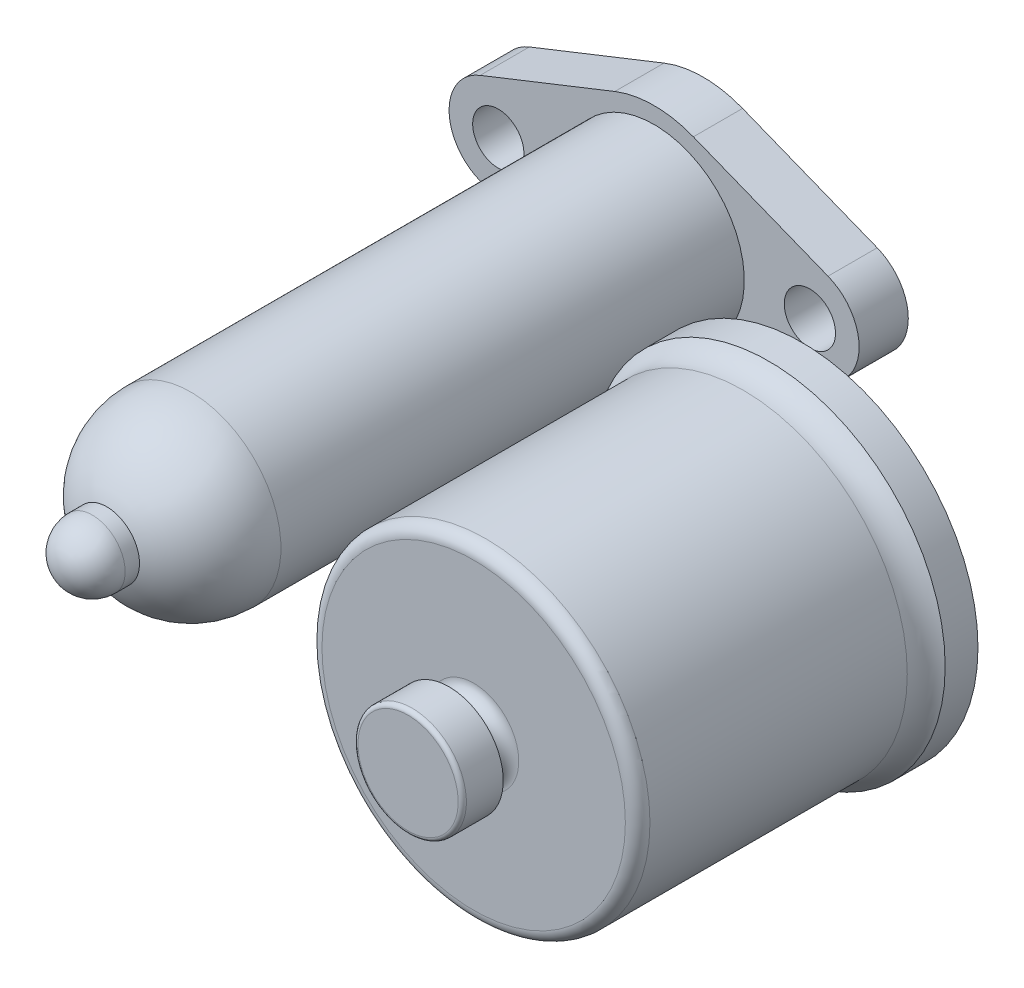
ISO-10303-21;
HEADER;
FILE_DESCRIPTION(('STEP AP214'),'2;1');
FILE_NAME('part.step','',(''),(''),'','','');
FILE_SCHEMA(('AUTOMOTIVE_DESIGN { 1 0 10303 214 1 1 1 1 }'));
ENDSEC;
DATA;
#1=APPLICATION_CONTEXT('core data for automotive mechanical design processes');
#2=APPLICATION_PROTOCOL_DEFINITION('international standard','automotive_design',2000,#1);
#3=PRODUCT_CONTEXT('',#1,'mechanical');
#4=PRODUCT('Part','Part','',(#3));
#5=PRODUCT_RELATED_PRODUCT_CATEGORY('part','',(#4));
#6=PRODUCT_DEFINITION_FORMATION('','',#4);
#7=PRODUCT_DEFINITION_CONTEXT('part definition',#1,'design');
#8=PRODUCT_DEFINITION('design','',#6,#7);
#9=PRODUCT_DEFINITION_SHAPE('','',#8);
#10=(LENGTH_UNIT() NAMED_UNIT(*) SI_UNIT(.MILLI.,.METRE.));
#11=(NAMED_UNIT(*) PLANE_ANGLE_UNIT() SI_UNIT($,.RADIAN.));
#12=(NAMED_UNIT(*) SI_UNIT($,.STERADIAN.) SOLID_ANGLE_UNIT());
#13=UNCERTAINTY_MEASURE_WITH_UNIT(LENGTH_MEASURE(1.E-05),#10,'distance_accuracy_value','');
#14=(GEOMETRIC_REPRESENTATION_CONTEXT(3) GLOBAL_UNCERTAINTY_ASSIGNED_CONTEXT((#13)) GLOBAL_UNIT_ASSIGNED_CONTEXT((#10,
#11,#12)) REPRESENTATION_CONTEXT('',''));
#15=CARTESIAN_POINT('',(0.,0.,0.));
#16=DIRECTION('',(0.,0.,1.));
#17=DIRECTION('',(1.,0.,0.));
#18=AXIS2_PLACEMENT_3D('',#15,#16,#17);
#19=CARTESIAN_POINT('',(119.,0.,-64.));
#20=DIRECTION('',(0.,0.,1.));
#21=DIRECTION('',(1.,0.,0.));
#22=AXIS2_PLACEMENT_3D('',#19,#20,#21);
#23=PLANE('',#22);
#24=CARTESIAN_POINT('',(84.9999999999999,-38.,-64.));
#25=DIRECTION('',(0.,0.,-1.));
#26=DIRECTION('',(0.,1.,0.));
#27=AXIS2_PLACEMENT_3D('',#24,#25,#26);
#28=CIRCLE('',#27,2.);
#29=CARTESIAN_POINT('',(84.9999999999999,-36.,-64.));
#30=VERTEX_POINT('',#29);
#31=EDGE_CURVE('E133',#30,#30,#28,.T.);
#32=ORIENTED_EDGE('',*,*,#31,.F.);
#33=EDGE_LOOP('',(#32));
#34=FACE_BOUND('',#33,.T.);
#35=CARTESIAN_POINT('',(47.,0.,-64.));
#36=DIRECTION('',(0.,0.,-1.));
#37=DIRECTION('',(1.,0.,0.));
#38=AXIS2_PLACEMENT_3D('',#35,#36,#37);
#39=CIRCLE('',#38,2.);
#40=CARTESIAN_POINT('',(49.,0.,-64.));
#41=VERTEX_POINT('',#40);
#42=EDGE_CURVE('E127',#41,#41,#39,.T.);
#43=ORIENTED_EDGE('',*,*,#42,.F.);
#44=EDGE_LOOP('',(#43));
#45=FACE_BOUND('',#44,.T.);
#46=CARTESIAN_POINT('',(85.0000000000004,38.,-64.));
#47=DIRECTION('',(0.,0.,-1.));
#48=DIRECTION('',(0.,-1.,0.));
#49=AXIS2_PLACEMENT_3D('',#46,#47,#48);
#50=CIRCLE('',#49,2.);
#51=CARTESIAN_POINT('',(85.0000000000004,36.,-64.));
#52=VERTEX_POINT('',#51);
#53=EDGE_CURVE('E121',#52,#52,#50,.T.);
#54=ORIENTED_EDGE('',*,*,#53,.F.);
#55=EDGE_LOOP('',(#54));
#56=FACE_BOUND('',#55,.T.);
#57=CARTESIAN_POINT('',(123.,0.,-64.));
#58=DIRECTION('',(0.,0.,-1.));
#59=DIRECTION('',(-1.,0.,0.));
#60=AXIS2_PLACEMENT_3D('',#57,#58,#59);
#61=CIRCLE('',#60,2.);
#62=CARTESIAN_POINT('',(121.,0.,-64.));
#63=VERTEX_POINT('',#62);
#64=EDGE_CURVE('E115',#63,#63,#61,.T.);
#65=ORIENTED_EDGE('',*,*,#64,.F.);
#66=EDGE_LOOP('',(#65));
#67=FACE_BOUND('',#66,.T.);
#68=CARTESIAN_POINT('',(85.,0.,-64.));
#69=DIRECTION('',(0.,0.,-1.));
#70=DIRECTION('',(-1.,0.,0.));
#71=AXIS2_PLACEMENT_3D('',#68,#69,#70);
#72=CIRCLE('',#71,34.);
#73=CARTESIAN_POINT('',(51.,0.,-64.));
#74=VERTEX_POINT('',#73);
#75=EDGE_CURVE('E111',#74,#74,#72,.T.);
#76=ORIENTED_EDGE('',*,*,#75,.F.);
#77=EDGE_LOOP('',(#76));
#78=FACE_BOUND('',#77,.T.);
#79=CARTESIAN_POINT('',(85.,0.,-64.));
#80=DIRECTION('',(0.,0.,-1.));
#81=DIRECTION('',(-1.,0.,0.));
#82=AXIS2_PLACEMENT_3D('',#79,#80,#81);
#83=CIRCLE('',#82,43.);
#84=CARTESIAN_POINT('',(42.,0.,-64.));
#85=VERTEX_POINT('',#84);
#86=EDGE_CURVE('E11',#85,#85,#83,.T.);
#87=ORIENTED_EDGE('',*,*,#86,.T.);
#88=EDGE_LOOP('',(#87));
#89=FACE_BOUND('',#88,.T.);
#90=ADVANCED_FACE('F41',(#34,#45,#56,#67,#78,#89),#23,.F.);
#91=CARTESIAN_POINT('',(85.,0.,-126.772662803404));
#92=DIRECTION('',(0.,0.,-1.));
#93=DIRECTION('',(-1.,0.,0.));
#94=AXIS2_PLACEMENT_3D('',#91,#92,#93);
#95=CYLINDRICAL_SURFACE('',#94,43.);
#96=ORIENTED_EDGE('',*,*,#86,.F.);
#97=EDGE_LOOP('',(#96));
#98=FACE_BOUND('',#97,.T.);
#99=CARTESIAN_POINT('',(85.,0.,-56.));
#100=DIRECTION('',(0.,0.,-1.));
#101=DIRECTION('',(-1.,0.,0.));
#102=AXIS2_PLACEMENT_3D('',#99,#100,#101);
#103=CIRCLE('',#102,43.);
#104=CARTESIAN_POINT('',(42.,0.,-56.));
#105=VERTEX_POINT('',#104);
#106=EDGE_CURVE('E47',#105,#105,#103,.T.);
#107=ORIENTED_EDGE('',*,*,#106,.T.);
#108=EDGE_LOOP('',(#107));
#109=FACE_BOUND('',#108,.T.);
#110=ADVANCED_FACE('F150',(#98,#109),#95,.T.);
#111=CARTESIAN_POINT('',(85.,0.,-49.7550020016016));
#112=DIRECTION('',(0.,0.,-1.));
#113=DIRECTION('',(-1.,0.,0.));
#114=AXIS2_PLACEMENT_3D('',#111,#112,#113);
#115=TOROIDAL_SURFACE('',#114,48.,8.00000000000001);
#116=ORIENTED_EDGE('',*,*,#106,.F.);
#117=EDGE_LOOP('',(#116));
#118=FACE_BOUND('',#117,.T.);
#119=CARTESIAN_POINT('',(85.,0.,-49.7550020016016));
#120=DIRECTION('',(0.,0.,-1.));
#121=DIRECTION('',(-1.,0.,0.));
#122=AXIS2_PLACEMENT_3D('',#119,#120,#121);
#123=CIRCLE('',#122,40.);
#124=CARTESIAN_POINT('',(45.,0.,-49.7550020016016));
#125=VERTEX_POINT('',#124);
#126=EDGE_CURVE('E51',#125,#125,#123,.T.);
#127=ORIENTED_EDGE('',*,*,#126,.T.);
#128=EDGE_LOOP('',(#127));
#129=FACE_BOUND('',#128,.T.);
#130=ADVANCED_FACE('F248',(#118,#129),#115,.F.);
#131=CARTESIAN_POINT('',(85.,0.,-126.772662803404));
#132=DIRECTION('',(0.,0.,-1.));
#133=DIRECTION('',(-1.,0.,0.));
#134=AXIS2_PLACEMENT_3D('',#131,#132,#133);
#135=CYLINDRICAL_SURFACE('',#134,40.);
#136=ORIENTED_EDGE('',*,*,#126,.F.);
#137=EDGE_LOOP('',(#136));
#138=FACE_BOUND('',#137,.T.);
#139=CARTESIAN_POINT('',(85.,0.,13.));
#140=DIRECTION('',(0.,0.,-1.));
#141=DIRECTION('',(-1.,0.,0.));
#142=AXIS2_PLACEMENT_3D('',#139,#140,#141);
#143=CIRCLE('',#142,40.);
#144=CARTESIAN_POINT('',(45.,0.,13.));
#145=VERTEX_POINT('',#144);
#146=EDGE_CURVE('E55',#145,#145,#143,.T.);
#147=ORIENTED_EDGE('',*,*,#146,.T.);
#148=EDGE_LOOP('',(#147));
#149=FACE_BOUND('',#148,.T.);
#150=ADVANCED_FACE('F244',(#138,#149),#135,.T.);
#151=CARTESIAN_POINT('',(85.,0.,13.));
#152=DIRECTION('',(0.,0.,-1.));
#153=DIRECTION('',(-1.,0.,0.));
#154=AXIS2_PLACEMENT_3D('',#151,#152,#153);
#155=TOROIDAL_SURFACE('',#154,37.,3.);
#156=ORIENTED_EDGE('',*,*,#146,.F.);
#157=EDGE_LOOP('',(#156));
#158=FACE_BOUND('',#157,.T.);
#159=CARTESIAN_POINT('',(85.,0.,16.));
#160=DIRECTION('',(0.,0.,-1.));
#161=DIRECTION('',(-1.,0.,0.));
#162=AXIS2_PLACEMENT_3D('',#159,#160,#161);
#163=CIRCLE('',#162,37.);
#164=CARTESIAN_POINT('',(48.0000000000001,0.,16.));
#165=VERTEX_POINT('',#164);
#166=EDGE_CURVE('E60',#165,#165,#163,.T.);
#167=ORIENTED_EDGE('',*,*,#166,.T.);
#168=EDGE_LOOP('',(#167));
#169=FACE_BOUND('',#168,.T.);
#170=ADVANCED_FACE('F240',(#158,#169),#155,.T.);
#171=CARTESIAN_POINT('',(122.,0.,16.));
#172=DIRECTION('',(0.,0.,-1.));
#173=DIRECTION('',(-1.,0.,0.));
#174=AXIS2_PLACEMENT_3D('',#171,#172,#173);
#175=PLANE('',#174);
#176=ORIENTED_EDGE('',*,*,#166,.F.);
#177=EDGE_LOOP('',(#176));
#178=FACE_BOUND('',#177,.T.);
#179=CARTESIAN_POINT('',(85.,0.,16.));
#180=DIRECTION('',(0.,0.,-1.));
#181=DIRECTION('',(-1.,0.,0.));
#182=AXIS2_PLACEMENT_3D('',#179,#180,#181);
#183=CIRCLE('',#182,11.);
#184=CARTESIAN_POINT('',(74.,0.,16.));
#185=VERTEX_POINT('',#184);
#186=EDGE_CURVE('E63',#185,#185,#183,.T.);
#187=ORIENTED_EDGE('',*,*,#186,.T.);
#188=EDGE_LOOP('',(#187));
#189=FACE_BOUND('',#188,.T.);
#190=ADVANCED_FACE('F236',(#178,#189),#175,.F.);
#191=CARTESIAN_POINT('',(85.,0.,19.));
#192=DIRECTION('',(0.,0.,-1.));
#193=DIRECTION('',(-1.,0.,0.));
#194=AXIS2_PLACEMENT_3D('',#191,#192,#193);
#195=TOROIDAL_SURFACE('',#194,11.,3.);
#196=ORIENTED_EDGE('',*,*,#186,.F.);
#197=EDGE_LOOP('',(#196));
#198=FACE_BOUND('',#197,.T.);
#199=CARTESIAN_POINT('',(85.,0.,19.));
#200=DIRECTION('',(0.,0.,-1.));
#201=DIRECTION('',(-1.,0.,0.));
#202=AXIS2_PLACEMENT_3D('',#199,#200,#201);
#203=CIRCLE('',#202,8.00000000000001);
#204=CARTESIAN_POINT('',(77.,0.,19.));
#205=VERTEX_POINT('',#204);
#206=EDGE_CURVE('E66',#205,#205,#203,.T.);
#207=ORIENTED_EDGE('',*,*,#206,.T.);
#208=EDGE_LOOP('',(#207));
#209=FACE_BOUND('',#208,.T.);
#210=ADVANCED_FACE('F232',(#198,#209),#195,.F.);
#211=CARTESIAN_POINT('',(85.,0.,-126.772662803404));
#212=DIRECTION('',(0.,0.,-1.));
#213=DIRECTION('',(-1.,0.,0.));
#214=AXIS2_PLACEMENT_3D('',#211,#212,#213);
#215=CYLINDRICAL_SURFACE('',#214,8.);
#216=ORIENTED_EDGE('',*,*,#206,.F.);
#217=EDGE_LOOP('',(#216));
#218=FACE_BOUND('',#217,.T.);
#219=CARTESIAN_POINT('',(85.,0.,22.));
#220=DIRECTION('',(0.,0.,-1.));
#221=DIRECTION('',(-1.,0.,0.));
#222=AXIS2_PLACEMENT_3D('',#219,#220,#221);
#223=CIRCLE('',#222,7.99999999999999);
#224=CARTESIAN_POINT('',(77.,0.,22.));
#225=VERTEX_POINT('',#224);
#226=EDGE_CURVE('E69',#225,#225,#223,.T.);
#227=ORIENTED_EDGE('',*,*,#226,.T.);
#228=EDGE_LOOP('',(#227));
#229=FACE_BOUND('',#228,.T.);
#230=ADVANCED_FACE('F228',(#218,#229),#215,.T.);
#231=CARTESIAN_POINT('',(93.,0.,22.));
#232=DIRECTION('',(0.,0.,1.));
#233=DIRECTION('',(1.,0.,0.));
#234=AXIS2_PLACEMENT_3D('',#231,#232,#233);
#235=PLANE('',#234);
#236=ORIENTED_EDGE('',*,*,#226,.F.);
#237=EDGE_LOOP('',(#236));
#238=FACE_BOUND('',#237,.T.);
#239=CARTESIAN_POINT('',(85.,0.,22.));
#240=DIRECTION('',(0.,0.,-1.));
#241=DIRECTION('',(-1.,0.,0.));
#242=AXIS2_PLACEMENT_3D('',#239,#240,#241);
#243=CIRCLE('',#242,13.2205);
#244=CARTESIAN_POINT('',(71.7795,0.,22.));
#245=VERTEX_POINT('',#244);
#246=EDGE_CURVE('E72',#245,#245,#243,.T.);
#247=ORIENTED_EDGE('',*,*,#246,.T.);
#248=EDGE_LOOP('',(#247));
#249=FACE_BOUND('',#248,.T.);
#250=ADVANCED_FACE('F224',(#238,#249),#235,.F.);
#251=CARTESIAN_POINT('',(85.,0.,-126.772662803404));
#252=DIRECTION('',(0.,0.,-1.));
#253=DIRECTION('',(-1.,0.,0.));
#254=AXIS2_PLACEMENT_3D('',#251,#252,#253);
#255=CYLINDRICAL_SURFACE('',#254,13.2205);
#256=ORIENTED_EDGE('',*,*,#246,.F.);
#257=EDGE_LOOP('',(#256));
#258=FACE_BOUND('',#257,.T.);
#259=CARTESIAN_POINT('',(85.,0.,31.));
#260=DIRECTION('',(0.,0.,-1.));
#261=DIRECTION('',(-1.,0.,0.));
#262=AXIS2_PLACEMENT_3D('',#259,#260,#261);
#263=CIRCLE('',#262,13.2205);
#264=CARTESIAN_POINT('',(71.7795,0.,31.));
#265=VERTEX_POINT('',#264);
#266=EDGE_CURVE('E75',#265,#265,#263,.T.);
#267=ORIENTED_EDGE('',*,*,#266,.T.);
#268=EDGE_LOOP('',(#267));
#269=FACE_BOUND('',#268,.T.);
#270=ADVANCED_FACE('F220',(#258,#269),#255,.T.);
#271=CARTESIAN_POINT('',(85.,0.,31.));
#272=DIRECTION('',(0.,0.,-1.));
#273=DIRECTION('',(-1.,0.,0.));
#274=AXIS2_PLACEMENT_3D('',#271,#272,#273);
#275=TOROIDAL_SURFACE('',#274,12.2205,1.);
#276=ORIENTED_EDGE('',*,*,#266,.F.);
#277=EDGE_LOOP('',(#276));
#278=FACE_BOUND('',#277,.T.);
#279=CARTESIAN_POINT('',(85.,0.,32.));
#280=DIRECTION('',(0.,0.,-1.));
#281=DIRECTION('',(-1.,0.,0.));
#282=AXIS2_PLACEMENT_3D('',#279,#280,#281);
#283=CIRCLE('',#282,12.2205);
#284=CARTESIAN_POINT('',(72.7795,0.,32.));
#285=VERTEX_POINT('',#284);
#286=EDGE_CURVE('E78',#285,#285,#283,.T.);
#287=ORIENTED_EDGE('',*,*,#286,.T.);
#288=EDGE_LOOP('',(#287));
#289=FACE_BOUND('',#288,.T.);
#290=ADVANCED_FACE('F216',(#278,#289),#275,.T.);
#291=CARTESIAN_POINT('',(97.2205,0.,32.));
#292=DIRECTION('',(0.,0.,-1.));
#293=DIRECTION('',(-1.,0.,0.));
#294=AXIS2_PLACEMENT_3D('',#291,#292,#293);
#295=PLANE('',#294);
#296=ORIENTED_EDGE('',*,*,#286,.F.);
#297=EDGE_LOOP('',(#296));
#298=FACE_BOUND('',#297,.T.);
#299=ADVANCED_FACE('F212',(#298),#295,.F.);
#300=CARTESIAN_POINT('',(85.,0.,23.));
#301=DIRECTION('',(0.,0.,1.));
#302=DIRECTION('',(1.,0.,0.));
#303=AXIS2_PLACEMENT_3D('',#300,#301,#302);
#304=PLANE('',#303);
#305=CARTESIAN_POINT('',(85.,0.,23.));
#306=DIRECTION('',(0.,0.,-1.));
#307=DIRECTION('',(-1.,0.,0.));
#308=AXIS2_PLACEMENT_3D('',#305,#306,#307);
#309=CIRCLE('',#308,1.49999999999999);
#310=CARTESIAN_POINT('',(83.5,0.,23.));
#311=VERTEX_POINT('',#310);
#312=EDGE_CURVE('E81',#311,#311,#309,.T.);
#313=ORIENTED_EDGE('',*,*,#312,.T.);
#314=EDGE_LOOP('',(#313));
#315=FACE_BOUND('',#314,.T.);
#316=ADVANCED_FACE('F208',(#315),#304,.F.);
#317=CARTESIAN_POINT('',(85.,0.,-126.772662803404));
#318=DIRECTION('',(0.,0.,-1.));
#319=DIRECTION('',(-1.,0.,0.));
#320=AXIS2_PLACEMENT_3D('',#317,#318,#319);
#321=CYLINDRICAL_SURFACE('',#320,1.49999999999999);
#322=ORIENTED_EDGE('',*,*,#312,.F.);
#323=EDGE_LOOP('',(#322));
#324=FACE_BOUND('',#323,.T.);
#325=CARTESIAN_POINT('',(85.,0.,14.3301270189223));
#326=DIRECTION('',(0.,0.,-1.));
#327=DIRECTION('',(-1.,0.,0.));
#328=AXIS2_PLACEMENT_3D('',#325,#326,#327);
#329=CIRCLE('',#328,1.49999999999999);
#330=CARTESIAN_POINT('',(83.5,0.,14.3301270189223));
#331=VERTEX_POINT('',#330);
#332=EDGE_CURVE('E84',#331,#331,#329,.T.);
#333=ORIENTED_EDGE('',*,*,#332,.T.);
#334=EDGE_LOOP('',(#333));
#335=FACE_BOUND('',#334,.T.);
#336=ADVANCED_FACE('F204',(#324,#335),#321,.F.);
#337=CARTESIAN_POINT('',(85.,0.,10.));
#338=DIRECTION('',(0.,0.,-1.));
#339=DIRECTION('',(-1.,0.,0.));
#340=AXIS2_PLACEMENT_3D('',#337,#338,#339);
#341=CONICAL_SURFACE('',#340,3.99999999999998,0.523598775598292);
#342=ORIENTED_EDGE('',*,*,#332,.F.);
#343=EDGE_LOOP('',(#342));
#344=FACE_BOUND('',#343,.T.);
#345=CARTESIAN_POINT('',(85.,0.,10.));
#346=DIRECTION('',(0.,0.,-1.));
#347=DIRECTION('',(-1.,0.,0.));
#348=AXIS2_PLACEMENT_3D('',#345,#346,#347);
#349=CIRCLE('',#348,3.99999999999998);
#350=CARTESIAN_POINT('',(81.,0.,10.));
#351=VERTEX_POINT('',#350);
#352=EDGE_CURVE('E87',#351,#351,#349,.T.);
#353=ORIENTED_EDGE('',*,*,#352,.T.);
#354=EDGE_LOOP('',(#353));
#355=FACE_BOUND('',#354,.T.);
#356=ADVANCED_FACE('F200',(#344,#355),#341,.F.);
#357=CARTESIAN_POINT('',(85.,0.,-126.772662803404));
#358=DIRECTION('',(0.,0.,-1.));
#359=DIRECTION('',(-1.,0.,0.));
#360=AXIS2_PLACEMENT_3D('',#357,#358,#359);
#361=CYLINDRICAL_SURFACE('',#360,3.99999999999998);
#362=ORIENTED_EDGE('',*,*,#352,.F.);
#363=EDGE_LOOP('',(#362));
#364=FACE_BOUND('',#363,.T.);
#365=CARTESIAN_POINT('',(85.,0.,-4.));
#366=DIRECTION('',(0.,0.,-1.));
#367=DIRECTION('',(-1.,0.,0.));
#368=AXIS2_PLACEMENT_3D('',#365,#366,#367);
#369=CIRCLE('',#368,3.99999999999998);
#370=CARTESIAN_POINT('',(81.,0.,-4.));
#371=VERTEX_POINT('',#370);
#372=EDGE_CURVE('E90',#371,#371,#369,.T.);
#373=ORIENTED_EDGE('',*,*,#372,.T.);
#374=EDGE_LOOP('',(#373));
#375=FACE_BOUND('',#374,.T.);
#376=ADVANCED_FACE('F196',(#364,#375),#361,.F.);
#377=CARTESIAN_POINT('',(89.,0.,-4.00000000000001));
#378=DIRECTION('',(0.,0.,1.));
#379=DIRECTION('',(1.,0.,0.));
#380=AXIS2_PLACEMENT_3D('',#377,#378,#379);
#381=PLANE('',#380);
#382=ORIENTED_EDGE('',*,*,#372,.F.);
#383=EDGE_LOOP('',(#382));
#384=FACE_BOUND('',#383,.T.);
#385=CARTESIAN_POINT('',(85.,0.,-4.));
#386=DIRECTION('',(0.,0.,-1.));
#387=DIRECTION('',(-1.,0.,0.));
#388=AXIS2_PLACEMENT_3D('',#385,#386,#387);
#389=CIRCLE('',#388,6.49139717449126);
#390=CARTESIAN_POINT('',(78.5086028255088,0.,-4.));
#391=VERTEX_POINT('',#390);
#392=EDGE_CURVE('E93',#391,#391,#389,.T.);
#393=ORIENTED_EDGE('',*,*,#392,.T.);
#394=EDGE_LOOP('',(#393));
#395=FACE_BOUND('',#394,.T.);
#396=ADVANCED_FACE('F192',(#384,#395),#381,.F.);
#397=CARTESIAN_POINT('',(85.,0.,-2.00000000000001));
#398=DIRECTION('',(0.,0.,-1.));
#399=DIRECTION('',(-1.,0.,0.));
#400=AXIS2_PLACEMENT_3D('',#397,#398,#399);
#401=TOROIDAL_SURFACE('',#400,6.49139717449127,2.);
#402=ORIENTED_EDGE('',*,*,#392,.F.);
#403=EDGE_LOOP('',(#402));
#404=FACE_BOUND('',#403,.T.);
#405=CARTESIAN_POINT('',(85.,0.,-2.54944225579476));
#406=DIRECTION('',(0.,0.,-1.));
#407=DIRECTION('',(-1.,0.,0.));
#408=AXIS2_PLACEMENT_3D('',#405,#406,#407);
#409=CIRCLE('',#408,8.41444506977291);
#410=CARTESIAN_POINT('',(76.5855549302271,0.,-2.54944225579476));
#411=VERTEX_POINT('',#410);
#412=EDGE_CURVE('E96',#411,#411,#409,.T.);
#413=ORIENTED_EDGE('',*,*,#412,.T.);
#414=EDGE_LOOP('',(#413));
#415=FACE_BOUND('',#414,.T.);
#416=ADVANCED_FACE('F188',(#404,#415),#401,.T.);
#417=CARTESIAN_POINT('',(85.,0.,8.54944225579476));
#418=DIRECTION('',(0.,0.,1.));
#419=DIRECTION('',(1.,0.,0.));
#420=AXIS2_PLACEMENT_3D('',#417,#418,#419);
#421=CONICAL_SURFACE('',#420,11.585554930227,0.278299659005111);
#422=ORIENTED_EDGE('',*,*,#412,.F.);
#423=EDGE_LOOP('',(#422));
#424=FACE_BOUND('',#423,.T.);
#425=CARTESIAN_POINT('',(85.,0.,8.54944225579476));
#426=DIRECTION('',(0.,0.,-1.));
#427=DIRECTION('',(-1.,0.,0.));
#428=AXIS2_PLACEMENT_3D('',#425,#426,#427);
#429=CIRCLE('',#428,11.585554930227);
#430=CARTESIAN_POINT('',(73.414445069773,0.,8.54944225579477));
#431=VERTEX_POINT('',#430);
#432=EDGE_CURVE('E99',#431,#431,#429,.T.);
#433=ORIENTED_EDGE('',*,*,#432,.T.);
#434=EDGE_LOOP('',(#433));
#435=FACE_BOUND('',#434,.T.);
#436=ADVANCED_FACE('F184',(#424,#435),#421,.T.);
#437=CARTESIAN_POINT('',(85.,0.,7.99999999999999));
#438=DIRECTION('',(0.,0.,-1.));
#439=DIRECTION('',(-1.,0.,0.));
#440=AXIS2_PLACEMENT_3D('',#437,#438,#439);
#441=TOROIDAL_SURFACE('',#440,13.5086028255087,2.00000000000002);
#442=ORIENTED_EDGE('',*,*,#432,.F.);
#443=EDGE_LOOP('',(#442));
#444=FACE_BOUND('',#443,.T.);
#445=CARTESIAN_POINT('',(85.,0.,10.));
#446=DIRECTION('',(0.,0.,-1.));
#447=DIRECTION('',(-1.,0.,0.));
#448=AXIS2_PLACEMENT_3D('',#445,#446,#447);
#449=CIRCLE('',#448,13.5086028255087);
#450=CARTESIAN_POINT('',(71.4913971744913,0.,10.));
#451=VERTEX_POINT('',#450);
#452=EDGE_CURVE('E102',#451,#451,#449,.T.);
#453=ORIENTED_EDGE('',*,*,#452,.T.);
#454=EDGE_LOOP('',(#453));
#455=FACE_BOUND('',#454,.T.);
#456=ADVANCED_FACE('F180',(#444,#455),#441,.F.);
#457=CARTESIAN_POINT('',(98.5086028255087,0.,10.));
#458=DIRECTION('',(0.,0.,1.));
#459=DIRECTION('',(1.,0.,0.));
#460=AXIS2_PLACEMENT_3D('',#457,#458,#459);
#461=PLANE('',#460);
#462=ORIENTED_EDGE('',*,*,#452,.F.);
#463=EDGE_LOOP('',(#462));
#464=FACE_BOUND('',#463,.T.);
#465=CARTESIAN_POINT('',(85.,0.,9.99999999999998));
#466=DIRECTION('',(0.,0.,-1.));
#467=DIRECTION('',(-1.,0.,0.));
#468=AXIS2_PLACEMENT_3D('',#465,#466,#467);
#469=CIRCLE('',#468,33.);
#470=CARTESIAN_POINT('',(52.,0.,9.99999999999998));
#471=VERTEX_POINT('',#470);
#472=EDGE_CURVE('E105',#471,#471,#469,.T.);
#473=ORIENTED_EDGE('',*,*,#472,.T.);
#474=EDGE_LOOP('',(#473));
#475=FACE_BOUND('',#474,.T.);
#476=ADVANCED_FACE('F172',(#464,#475),#461,.F.);
#477=CARTESIAN_POINT('',(85.,0.,9.));
#478=DIRECTION('',(0.,0.,-1.));
#479=DIRECTION('',(-1.,0.,0.));
#480=AXIS2_PLACEMENT_3D('',#477,#478,#479);
#481=TOROIDAL_SURFACE('',#480,33.,1.);
#482=ORIENTED_EDGE('',*,*,#472,.F.);
#483=EDGE_LOOP('',(#482));
#484=FACE_BOUND('',#483,.T.);
#485=CARTESIAN_POINT('',(85.,0.,8.99999999999998));
#486=DIRECTION('',(0.,0.,-1.));
#487=DIRECTION('',(-1.,0.,0.));
#488=AXIS2_PLACEMENT_3D('',#485,#486,#487);
#489=CIRCLE('',#488,34.);
#490=CARTESIAN_POINT('',(51.,0.,8.99999999999998));
#491=VERTEX_POINT('',#490);
#492=EDGE_CURVE('E108',#491,#491,#489,.T.);
#493=ORIENTED_EDGE('',*,*,#492,.T.);
#494=EDGE_LOOP('',(#493));
#495=FACE_BOUND('',#494,.T.);
#496=ADVANCED_FACE('F162',(#484,#495),#481,.F.);
#497=CARTESIAN_POINT('',(85.,0.,-126.772662803404));
#498=DIRECTION('',(0.,0.,-1.));
#499=DIRECTION('',(-1.,0.,0.));
#500=AXIS2_PLACEMENT_3D('',#497,#498,#499);
#501=CYLINDRICAL_SURFACE('',#500,34.);
#502=ORIENTED_EDGE('',*,*,#492,.F.);
#503=EDGE_LOOP('',(#502));
#504=FACE_BOUND('',#503,.T.);
#505=ORIENTED_EDGE('',*,*,#75,.T.);
#506=EDGE_LOOP('',(#505));
#507=FACE_BOUND('',#506,.T.);
#508=ADVANCED_FACE('F159',(#504,#507),#501,.F.);
#509=CARTESIAN_POINT('',(123.,0.,-56.));
#510=DIRECTION('',(0.,0.,-1.));
#511=DIRECTION('',(-1.,0.,0.));
#512=AXIS2_PLACEMENT_3D('',#509,#510,#511);
#513=CYLINDRICAL_SURFACE('',#512,2.);
#514=CARTESIAN_POINT('',(123.,0.,-56.));
#515=DIRECTION('',(0.,0.,-1.));
#516=DIRECTION('',(-1.,0.,0.));
#517=AXIS2_PLACEMENT_3D('',#514,#515,#516);
#518=CIRCLE('',#517,2.);
#519=CARTESIAN_POINT('',(121.,0.,-56.));
#520=VERTEX_POINT('',#519);
#521=EDGE_CURVE('E114',#520,#520,#518,.T.);
#522=ORIENTED_EDGE('',*,*,#521,.F.);
#523=EDGE_LOOP('',(#522));
#524=FACE_BOUND('',#523,.T.);
#525=ORIENTED_EDGE('',*,*,#64,.T.);
#526=EDGE_LOOP('',(#525));
#527=FACE_BOUND('',#526,.T.);
#528=ADVANCED_FACE('F161',(#524,#527),#513,.F.);
#529=CARTESIAN_POINT('',(123.,0.,-56.));
#530=DIRECTION('',(0.,0.,-1.));
#531=DIRECTION('',(-1.,0.,0.));
#532=AXIS2_PLACEMENT_3D('',#529,#530,#531);
#533=PLANE('',#532);
#534=ORIENTED_EDGE('',*,*,#521,.T.);
#535=EDGE_LOOP('',(#534));
#536=FACE_BOUND('',#535,.T.);
#537=ADVANCED_FACE('F169',(#536),#533,.T.);
#538=CARTESIAN_POINT('',(85.0000000000004,38.,-56.));
#539=DIRECTION('',(0.,0.,-1.));
#540=DIRECTION('',(-1.,0.,0.));
#541=AXIS2_PLACEMENT_3D('',#538,#539,#540);
#542=CYLINDRICAL_SURFACE('',#541,2.);
#543=CARTESIAN_POINT('',(85.0000000000004,38.,-56.));
#544=DIRECTION('',(0.,0.,-1.));
#545=DIRECTION('',(0.,-1.,0.));
#546=AXIS2_PLACEMENT_3D('',#543,#544,#545);
#547=CIRCLE('',#546,2.);
#548=CARTESIAN_POINT('',(85.0000000000004,36.,-56.));
#549=VERTEX_POINT('',#548);
#550=EDGE_CURVE('E124',#549,#549,#547,.T.);
#551=ORIENTED_EDGE('',*,*,#550,.F.);
#552=EDGE_LOOP('',(#551));
#553=FACE_BOUND('',#552,.T.);
#554=ORIENTED_EDGE('',*,*,#53,.T.);
#555=EDGE_LOOP('',(#554));
#556=FACE_BOUND('',#555,.T.);
#557=ADVANCED_FACE('F356',(#553,#556),#542,.F.);
#558=CARTESIAN_POINT('',(85.0000000000004,38.,-56.));
#559=DIRECTION('',(0.,0.,-1.));
#560=DIRECTION('',(0.,-1.,0.));
#561=AXIS2_PLACEMENT_3D('',#558,#559,#560);
#562=PLANE('',#561);
#563=ORIENTED_EDGE('',*,*,#550,.T.);
#564=EDGE_LOOP('',(#563));
#565=FACE_BOUND('',#564,.T.);
#566=ADVANCED_FACE('F370',(#565),#562,.T.);
#567=CARTESIAN_POINT('',(47.,0.,-56.));
#568=DIRECTION('',(0.,0.,-1.));
#569=DIRECTION('',(-1.,0.,0.));
#570=AXIS2_PLACEMENT_3D('',#567,#568,#569);
#571=CYLINDRICAL_SURFACE('',#570,2.);
#572=CARTESIAN_POINT('',(47.,0.,-56.));
#573=DIRECTION('',(0.,0.,-1.));
#574=DIRECTION('',(1.,0.,0.));
#575=AXIS2_PLACEMENT_3D('',#572,#573,#574);
#576=CIRCLE('',#575,2.);
#577=CARTESIAN_POINT('',(49.,0.,-56.));
#578=VERTEX_POINT('',#577);
#579=EDGE_CURVE('E130',#578,#578,#576,.T.);
#580=ORIENTED_EDGE('',*,*,#579,.F.);
#581=EDGE_LOOP('',(#580));
#582=FACE_BOUND('',#581,.T.);
#583=ORIENTED_EDGE('',*,*,#42,.T.);
#584=EDGE_LOOP('',(#583));
#585=FACE_BOUND('',#584,.T.);
#586=ADVANCED_FACE('F380',(#582,#585),#571,.F.);
#587=CARTESIAN_POINT('',(47.,0.,-56.));
#588=DIRECTION('',(0.,0.,-1.));
#589=DIRECTION('',(1.,0.,0.));
#590=AXIS2_PLACEMENT_3D('',#587,#588,#589);
#591=PLANE('',#590);
#592=ORIENTED_EDGE('',*,*,#579,.T.);
#593=EDGE_LOOP('',(#592));
#594=FACE_BOUND('',#593,.T.);
#595=ADVANCED_FACE('F144',(#594),#591,.T.);
#596=CARTESIAN_POINT('',(84.9999999999999,-38.,-56.));
#597=DIRECTION('',(0.,0.,-1.));
#598=DIRECTION('',(-1.,0.,0.));
#599=AXIS2_PLACEMENT_3D('',#596,#597,#598);
#600=CYLINDRICAL_SURFACE('',#599,2.);
#601=CARTESIAN_POINT('',(84.9999999999999,-38.,-56.));
#602=DIRECTION('',(0.,0.,-1.));
#603=DIRECTION('',(0.,1.,0.));
#604=AXIS2_PLACEMENT_3D('',#601,#602,#603);
#605=CIRCLE('',#604,2.);
#606=CARTESIAN_POINT('',(84.9999999999999,-36.,-56.));
#607=VERTEX_POINT('',#606);
#608=EDGE_CURVE('E118',#607,#607,#605,.T.);
#609=ORIENTED_EDGE('',*,*,#608,.F.);
#610=EDGE_LOOP('',(#609));
#611=FACE_BOUND('',#610,.T.);
#612=ORIENTED_EDGE('',*,*,#31,.T.);
#613=EDGE_LOOP('',(#612));
#614=FACE_BOUND('',#613,.T.);
#615=ADVANCED_FACE('F141',(#611,#614),#600,.F.);
#616=CARTESIAN_POINT('',(84.9999999999999,-38.,-56.));
#617=DIRECTION('',(0.,0.,-1.));
#618=DIRECTION('',(0.,1.,0.));
#619=AXIS2_PLACEMENT_3D('',#616,#617,#618);
#620=PLANE('',#619);
#621=ORIENTED_EDGE('',*,*,#608,.T.);
#622=EDGE_LOOP('',(#621));
#623=FACE_BOUND('',#622,.T.);
#624=ADVANCED_FACE('F139',(#623),#620,.T.);
#625=CLOSED_SHELL('',(#90,#110,#130,#150,#170,#190,#210,#230,#250,#270,#290,#299,#316,#336,#356,
#376,#396,#416,#436,#456,#476,#496,#508,#528,#537,#557,#566,#586,#595,#615,#624));
#626=MANIFOLD_SOLID_BREP('B2',#625);
#627=CARTESIAN_POINT('',(-38.,0.,-125.));
#628=DIRECTION('',(0.,0.,1.));
#629=DIRECTION('',(1.,0.,0.));
#630=AXIS2_PLACEMENT_3D('',#627,#628,#629);
#631=CYLINDRICAL_SURFACE('',#630,12.);
#632=CARTESIAN_POINT('',(-38.,0.,-113.));
#633=DIRECTION('',(0.,0.,-1.));
#634=DIRECTION('',(-1.,0.,0.));
#635=AXIS2_PLACEMENT_3D('',#632,#633,#634);
#636=CIRCLE('',#635,12.);
#637=CARTESIAN_POINT('',(-42.421052631579,-11.1559084627299,-113.));
#638=VERTEX_POINT('',#637);
#639=CARTESIAN_POINT('',(-42.421052631579,11.1559084627299,-113.));
#640=VERTEX_POINT('',#639);
#641=EDGE_CURVE('E608',#638,#640,#636,.T.);
#642=ORIENTED_EDGE('',*,*,#641,.T.);
#643=DIRECTION('',(0.,0.,1.));
#644=VECTOR('',#643,1.);
#645=CARTESIAN_POINT('',(-42.421052631579,11.1559084627299,-125.));
#646=LINE('',#645,#644);
#647=CARTESIAN_POINT('',(-42.421052631579,11.1559084627299,-125.));
#648=VERTEX_POINT('',#647);
#649=EDGE_CURVE('E637',#648,#640,#646,.T.);
#650=ORIENTED_EDGE('',*,*,#649,.F.);
#651=CARTESIAN_POINT('',(-38.,0.,-125.));
#652=DIRECTION('',(0.,0.,-1.));
#653=DIRECTION('',(-1.,0.,0.));
#654=AXIS2_PLACEMENT_3D('',#651,#652,#653);
#655=CIRCLE('',#654,12.);
#656=CARTESIAN_POINT('',(-42.421052631579,-11.1559084627299,-125.));
#657=VERTEX_POINT('',#656);
#658=EDGE_CURVE('E626',#657,#648,#655,.T.);
#659=ORIENTED_EDGE('',*,*,#658,.F.);
#660=DIRECTION('',(0.,0.,1.));
#661=VECTOR('',#660,1.);
#662=CARTESIAN_POINT('',(-42.421052631579,-11.1559084627299,-125.));
#663=LINE('',#662,#661);
#664=EDGE_CURVE('E523',#657,#638,#663,.T.);
#665=ORIENTED_EDGE('',*,*,#664,.T.);
#666=EDGE_LOOP('',(#642,#650,#659,#665));
#667=FACE_BOUND('',#666,.T.);
#668=ADVANCED_FACE('F502',(#667),#631,.T.);
#669=CARTESIAN_POINT('',(-42.421052631579,11.1559084627299,-125.));
#670=DIRECTION('',(0.368421052631579,-0.929659038560826,0.));
#671=DIRECTION('',(0.929659038560826,0.368421052631579,0.));
#672=AXIS2_PLACEMENT_3D('',#669,#670,#671);
#673=PLANE('',#672);
#674=DIRECTION('',(0.929659038560826,0.368421052631579,0.));
#675=VECTOR('',#674,1.);
#676=CARTESIAN_POINT('',(-42.421052631579,11.1559084627299,-113.));
#677=LINE('',#676,#675);
#678=CARTESIAN_POINT('',(-9.57894736842107,24.1711350025815,-113.));
#679=VERTEX_POINT('',#678);
#680=EDGE_CURVE('E610',#640,#679,#677,.T.);
#681=ORIENTED_EDGE('',*,*,#680,.T.);
#682=DIRECTION('',(0.,0.,1.));
#683=VECTOR('',#682,1.);
#684=CARTESIAN_POINT('',(-9.57894736842108,24.1711350025815,-125.));
#685=LINE('',#684,#683);
#686=CARTESIAN_POINT('',(-9.57894736842108,24.1711350025815,-125.));
#687=VERTEX_POINT('',#686);
#688=EDGE_CURVE('E634',#687,#679,#685,.T.);
#689=ORIENTED_EDGE('',*,*,#688,.F.);
#690=DIRECTION('',(0.929659038560826,0.368421052631579,0.));
#691=VECTOR('',#690,1.);
#692=CARTESIAN_POINT('',(-42.421052631579,11.1559084627299,-125.));
#693=LINE('',#692,#691);
#694=EDGE_CURVE('E562',#648,#687,#693,.T.);
#695=ORIENTED_EDGE('',*,*,#694,.F.);
#696=ORIENTED_EDGE('',*,*,#649,.T.);
#697=EDGE_LOOP('',(#681,#689,#695,#696));
#698=FACE_BOUND('',#697,.T.);
#699=ADVANCED_FACE('F700',(#698),#673,.F.);
#700=CARTESIAN_POINT('',(0.,0.,-125.));
#701=DIRECTION('',(0.,0.,1.));
#702=DIRECTION('',(1.,0.,0.));
#703=AXIS2_PLACEMENT_3D('',#700,#701,#702);
#704=CYLINDRICAL_SURFACE('',#703,26.);
#705=CARTESIAN_POINT('',(0.,0.,-113.));
#706=DIRECTION('',(0.,0.,-1.));
#707=DIRECTION('',(-1.,0.,0.));
#708=AXIS2_PLACEMENT_3D('',#705,#706,#707);
#709=CIRCLE('',#708,26.);
#710=CARTESIAN_POINT('',(9.57894736842105,24.1711350025815,-113.));
#711=VERTEX_POINT('',#710);
#712=EDGE_CURVE('E612',#679,#711,#709,.T.);
#713=ORIENTED_EDGE('',*,*,#712,.T.);
#714=DIRECTION('',(0.,0.,1.));
#715=VECTOR('',#714,1.);
#716=CARTESIAN_POINT('',(9.57894736842105,24.1711350025815,-125.));
#717=LINE('',#716,#715);
#718=CARTESIAN_POINT('',(9.57894736842105,24.1711350025815,-125.));
#719=VERTEX_POINT('',#718);
#720=EDGE_CURVE('E632',#719,#711,#717,.T.);
#721=ORIENTED_EDGE('',*,*,#720,.F.);
#722=CARTESIAN_POINT('',(0.,0.,-125.));
#723=DIRECTION('',(0.,0.,-1.));
#724=DIRECTION('',(-1.,0.,0.));
#725=AXIS2_PLACEMENT_3D('',#722,#723,#724);
#726=CIRCLE('',#725,26.);
#727=EDGE_CURVE('E674',#687,#719,#726,.T.);
#728=ORIENTED_EDGE('',*,*,#727,.F.);
#729=ORIENTED_EDGE('',*,*,#688,.T.);
#730=EDGE_LOOP('',(#713,#721,#728,#729));
#731=FACE_BOUND('',#730,.T.);
#732=ADVANCED_FACE('F684',(#731),#704,.T.);
#733=CARTESIAN_POINT('',(42.4210526315789,11.1559084627299,-125.));
#734=DIRECTION('',(0.368421052631579,0.929659038560826,0.));
#735=DIRECTION('',(-0.929659038560826,0.368421052631579,0.));
#736=AXIS2_PLACEMENT_3D('',#733,#734,#735);
#737=PLANE('',#736);
#738=DIRECTION('',(-0.929659038560826,0.368421052631579,0.));
#739=VECTOR('',#738,1.);
#740=CARTESIAN_POINT('',(42.4210526315789,11.1559084627299,-113.));
#741=LINE('',#740,#739);
#742=CARTESIAN_POINT('',(42.4210526315789,11.1559084627299,-113.));
#743=VERTEX_POINT('',#742);
#744=EDGE_CURVE('E615',#743,#711,#741,.T.);
#745=ORIENTED_EDGE('',*,*,#744,.F.);
#746=DIRECTION('',(0.,0.,1.));
#747=VECTOR('',#746,1.);
#748=CARTESIAN_POINT('',(42.4210526315789,11.1559084627299,-125.));
#749=LINE('',#748,#747);
#750=CARTESIAN_POINT('',(42.4210526315789,11.1559084627299,-125.));
#751=VERTEX_POINT('',#750);
#752=EDGE_CURVE('E630',#751,#743,#749,.T.);
#753=ORIENTED_EDGE('',*,*,#752,.F.);
#754=DIRECTION('',(-0.929659038560826,0.368421052631579,0.));
#755=VECTOR('',#754,1.);
#756=CARTESIAN_POINT('',(42.4210526315789,11.1559084627299,-125.));
#757=LINE('',#756,#755);
#758=EDGE_CURVE('E676',#751,#719,#757,.T.);
#759=ORIENTED_EDGE('',*,*,#758,.T.);
#760=ORIENTED_EDGE('',*,*,#720,.T.);
#761=EDGE_LOOP('',(#745,#753,#759,#760));
#762=FACE_BOUND('',#761,.T.);
#763=ADVANCED_FACE('F680',(#762),#737,.T.);
#764=CARTESIAN_POINT('',(38.,0.,-125.));
#765=DIRECTION('',(0.,0.,1.));
#766=DIRECTION('',(1.,0.,0.));
#767=AXIS2_PLACEMENT_3D('',#764,#765,#766);
#768=CYLINDRICAL_SURFACE('',#767,12.);
#769=CARTESIAN_POINT('',(38.,0.,-113.));
#770=DIRECTION('',(0.,0.,-1.));
#771=DIRECTION('',(-1.,0.,0.));
#772=AXIS2_PLACEMENT_3D('',#769,#770,#771);
#773=CIRCLE('',#772,12.);
#774=CARTESIAN_POINT('',(42.4210526315789,-11.1559084627299,-113.));
#775=VERTEX_POINT('',#774);
#776=EDGE_CURVE('E618',#743,#775,#773,.T.);
#777=ORIENTED_EDGE('',*,*,#776,.T.);
#778=DIRECTION('',(0.,0.,1.));
#779=VECTOR('',#778,1.);
#780=CARTESIAN_POINT('',(42.4210526315789,-11.1559084627299,-125.));
#781=LINE('',#780,#779);
#782=CARTESIAN_POINT('',(42.4210526315789,-11.1559084627299,-125.));
#783=VERTEX_POINT('',#782);
#784=EDGE_CURVE('E599',#783,#775,#781,.T.);
#785=ORIENTED_EDGE('',*,*,#784,.F.);
#786=CARTESIAN_POINT('',(38.,0.,-125.));
#787=DIRECTION('',(0.,0.,-1.));
#788=DIRECTION('',(-1.,0.,0.));
#789=AXIS2_PLACEMENT_3D('',#786,#787,#788);
#790=CIRCLE('',#789,12.);
#791=EDGE_CURVE('E586',#751,#783,#790,.T.);
#792=ORIENTED_EDGE('',*,*,#791,.F.);
#793=ORIENTED_EDGE('',*,*,#752,.T.);
#794=EDGE_LOOP('',(#777,#785,#792,#793));
#795=FACE_BOUND('',#794,.T.);
#796=ADVANCED_FACE('F690',(#795),#768,.T.);
#797=CARTESIAN_POINT('',(42.4210526315789,-11.1559084627299,-125.));
#798=DIRECTION('',(-0.368421052631579,0.929659038560826,0.));
#799=DIRECTION('',(-0.929659038560826,-0.368421052631579,0.));
#800=AXIS2_PLACEMENT_3D('',#797,#798,#799);
#801=PLANE('',#800);
#802=DIRECTION('',(-0.929659038560826,-0.368421052631579,0.));
#803=VECTOR('',#802,1.);
#804=CARTESIAN_POINT('',(42.4210526315789,-11.1559084627299,-113.));
#805=LINE('',#804,#803);
#806=CARTESIAN_POINT('',(9.57894736842105,-24.1711350025815,-113.));
#807=VERTEX_POINT('',#806);
#808=EDGE_CURVE('E595',#775,#807,#805,.T.);
#809=ORIENTED_EDGE('',*,*,#808,.T.);
#810=DIRECTION('',(0.,0.,1.));
#811=VECTOR('',#810,1.);
#812=CARTESIAN_POINT('',(9.57894736842105,-24.1711350025815,-125.));
#813=LINE('',#812,#811);
#814=CARTESIAN_POINT('',(9.57894736842105,-24.1711350025815,-125.));
#815=VERTEX_POINT('',#814);
#816=EDGE_CURVE('E592',#815,#807,#813,.T.);
#817=ORIENTED_EDGE('',*,*,#816,.F.);
#818=DIRECTION('',(-0.929659038560826,-0.368421052631579,0.));
#819=VECTOR('',#818,1.);
#820=CARTESIAN_POINT('',(42.4210526315789,-11.1559084627299,-125.));
#821=LINE('',#820,#819);
#822=EDGE_CURVE('E577',#783,#815,#821,.T.);
#823=ORIENTED_EDGE('',*,*,#822,.F.);
#824=ORIENTED_EDGE('',*,*,#784,.T.);
#825=EDGE_LOOP('',(#809,#817,#823,#824));
#826=FACE_BOUND('',#825,.T.);
#827=ADVANCED_FACE('F593',(#826),#801,.F.);
#828=CARTESIAN_POINT('',(0.,0.,-125.));
#829=DIRECTION('',(0.,0.,1.));
#830=DIRECTION('',(1.,0.,0.));
#831=AXIS2_PLACEMENT_3D('',#828,#829,#830);
#832=CYLINDRICAL_SURFACE('',#831,26.);
#833=CARTESIAN_POINT('',(0.,0.,-113.));
#834=DIRECTION('',(0.,0.,-1.));
#835=DIRECTION('',(-1.,0.,0.));
#836=AXIS2_PLACEMENT_3D('',#833,#834,#835);
#837=CIRCLE('',#836,26.);
#838=CARTESIAN_POINT('',(-9.57894736842108,-24.1711350025815,-113.));
#839=VERTEX_POINT('',#838);
#840=EDGE_CURVE('E621',#807,#839,#837,.T.);
#841=ORIENTED_EDGE('',*,*,#840,.T.);
#842=DIRECTION('',(0.,0.,1.));
#843=VECTOR('',#842,1.);
#844=CARTESIAN_POINT('',(-9.57894736842108,-24.1711350025815,-125.));
#845=LINE('',#844,#843);
#846=CARTESIAN_POINT('',(-9.57894736842108,-24.1711350025815,-125.));
#847=VERTEX_POINT('',#846);
#848=EDGE_CURVE('E600',#847,#839,#845,.T.);
#849=ORIENTED_EDGE('',*,*,#848,.F.);
#850=CARTESIAN_POINT('',(0.,0.,-125.));
#851=DIRECTION('',(0.,0.,-1.));
#852=DIRECTION('',(-1.,0.,0.));
#853=AXIS2_PLACEMENT_3D('',#850,#851,#852);
#854=CIRCLE('',#853,26.);
#855=EDGE_CURVE('E582',#815,#847,#854,.T.);
#856=ORIENTED_EDGE('',*,*,#855,.F.);
#857=ORIENTED_EDGE('',*,*,#816,.T.);
#858=EDGE_LOOP('',(#841,#849,#856,#857));
#859=FACE_BOUND('',#858,.T.);
#860=ADVANCED_FACE('F602',(#859),#832,.T.);
#861=CARTESIAN_POINT('',(-42.421052631579,-11.1559084627299,-125.));
#862=DIRECTION('',(-0.368421052631579,-0.929659038560826,0.));
#863=DIRECTION('',(0.929659038560826,-0.368421052631579,0.));
#864=AXIS2_PLACEMENT_3D('',#861,#862,#863);
#865=PLANE('',#864);
#866=DIRECTION('',(0.929659038560826,-0.368421052631579,0.));
#867=VECTOR('',#866,1.);
#868=CARTESIAN_POINT('',(-42.421052631579,-11.1559084627299,-113.));
#869=LINE('',#868,#867);
#870=EDGE_CURVE('E623',#638,#839,#869,.T.);
#871=ORIENTED_EDGE('',*,*,#870,.F.);
#872=ORIENTED_EDGE('',*,*,#664,.F.);
#873=DIRECTION('',(0.929659038560826,-0.368421052631579,0.));
#874=VECTOR('',#873,1.);
#875=CARTESIAN_POINT('',(-42.421052631579,-11.1559084627299,-125.));
#876=LINE('',#875,#874);
#877=EDGE_CURVE('E603',#657,#847,#876,.T.);
#878=ORIENTED_EDGE('',*,*,#877,.T.);
#879=ORIENTED_EDGE('',*,*,#848,.T.);
#880=EDGE_LOOP('',(#871,#872,#878,#879));
#881=FACE_BOUND('',#880,.T.);
#882=ADVANCED_FACE('F756',(#881),#865,.T.);
#883=CARTESIAN_POINT('',(-38.,0.,-125.));
#884=DIRECTION('',(0.,0.,-1.));
#885=DIRECTION('',(-1.,0.,0.));
#886=AXIS2_PLACEMENT_3D('',#883,#884,#885);
#887=PLANE('',#886);
#888=CARTESIAN_POINT('',(-38.,0.,-125.));
#889=DIRECTION('',(0.,0.,-1.));
#890=DIRECTION('',(-1.,0.,0.));
#891=AXIS2_PLACEMENT_3D('',#888,#889,#890);
#892=CIRCLE('',#891,6.25);
#893=CARTESIAN_POINT('',(-44.25,0.,-125.));
#894=VERTEX_POINT('',#893);
#895=EDGE_CURVE('E657',#894,#894,#892,.T.);
#896=ORIENTED_EDGE('',*,*,#895,.F.);
#897=EDGE_LOOP('',(#896));
#898=FACE_BOUND('',#897,.T.);
#899=CARTESIAN_POINT('',(0.,0.,-125.));
#900=DIRECTION('',(0.,0.,-1.));
#901=DIRECTION('',(-1.,0.,0.));
#902=AXIS2_PLACEMENT_3D('',#899,#900,#901);
#903=CIRCLE('',#902,16.);
#904=CARTESIAN_POINT('',(-16.,0.,-125.));
#905=VERTEX_POINT('',#904);
#906=EDGE_CURVE('E662',#905,#905,#903,.T.);
#907=ORIENTED_EDGE('',*,*,#906,.F.);
#908=EDGE_LOOP('',(#907));
#909=FACE_BOUND('',#908,.T.);
#910=CARTESIAN_POINT('',(38.,0.,-125.));
#911=DIRECTION('',(0.,0.,-1.));
#912=DIRECTION('',(-1.,0.,0.));
#913=AXIS2_PLACEMENT_3D('',#910,#911,#912);
#914=CIRCLE('',#913,6.25);
#915=CARTESIAN_POINT('',(31.75,0.,-125.));
#916=VERTEX_POINT('',#915);
#917=EDGE_CURVE('E667',#916,#916,#914,.T.);
#918=ORIENTED_EDGE('',*,*,#917,.F.);
#919=EDGE_LOOP('',(#918));
#920=FACE_BOUND('',#919,.T.);
#921=ORIENTED_EDGE('',*,*,#658,.T.);
#922=ORIENTED_EDGE('',*,*,#694,.T.);
#923=ORIENTED_EDGE('',*,*,#727,.T.);
#924=ORIENTED_EDGE('',*,*,#758,.F.);
#925=ORIENTED_EDGE('',*,*,#791,.T.);
#926=ORIENTED_EDGE('',*,*,#822,.T.);
#927=ORIENTED_EDGE('',*,*,#855,.T.);
#928=ORIENTED_EDGE('',*,*,#877,.F.);
#929=EDGE_LOOP('',(#921,#922,#923,#924,#925,#926,#927,#928));
#930=FACE_BOUND('',#929,.T.);
#931=ADVANCED_FACE('F579',(#898,#909,#920,#930),#887,.T.);
#932=CARTESIAN_POINT('',(-38.,0.,-113.));
#933=DIRECTION('',(0.,0.,-1.));
#934=DIRECTION('',(-1.,0.,0.));
#935=AXIS2_PLACEMENT_3D('',#932,#933,#934);
#936=PLANE('',#935);
#937=CARTESIAN_POINT('',(-38.,0.,-113.));
#938=DIRECTION('',(0.,0.,-1.));
#939=DIRECTION('',(-1.,0.,0.));
#940=AXIS2_PLACEMENT_3D('',#937,#938,#939);
#941=CIRCLE('',#940,6.25);
#942=CARTESIAN_POINT('',(-44.25,0.,-113.));
#943=VERTEX_POINT('',#942);
#944=EDGE_CURVE('E506',#943,#943,#941,.T.);
#945=ORIENTED_EDGE('',*,*,#944,.T.);
#946=EDGE_LOOP('',(#945));
#947=FACE_BOUND('',#946,.T.);
#948=CARTESIAN_POINT('',(38.,0.,-113.));
#949=DIRECTION('',(0.,0.,-1.));
#950=DIRECTION('',(-1.,0.,0.));
#951=AXIS2_PLACEMENT_3D('',#948,#949,#950);
#952=CIRCLE('',#951,6.25);
#953=CARTESIAN_POINT('',(31.75,0.,-113.));
#954=VERTEX_POINT('',#953);
#955=EDGE_CURVE('E655',#954,#954,#952,.T.);
#956=ORIENTED_EDGE('',*,*,#955,.T.);
#957=EDGE_LOOP('',(#956));
#958=FACE_BOUND('',#957,.T.);
#959=CARTESIAN_POINT('',(0.,0.,-113.));
#960=DIRECTION('',(0.,0.,-1.));
#961=DIRECTION('',(-1.,0.,0.));
#962=AXIS2_PLACEMENT_3D('',#959,#960,#961);
#963=CIRCLE('',#962,22.);
#964=CARTESIAN_POINT('',(-22.,0.,-113.));
#965=VERTEX_POINT('',#964);
#966=EDGE_CURVE('E648',#965,#965,#963,.T.);
#967=ORIENTED_EDGE('',*,*,#966,.T.);
#968=EDGE_LOOP('',(#967));
#969=FACE_BOUND('',#968,.T.);
#970=ORIENTED_EDGE('',*,*,#641,.F.);
#971=ORIENTED_EDGE('',*,*,#870,.T.);
#972=ORIENTED_EDGE('',*,*,#840,.F.);
#973=ORIENTED_EDGE('',*,*,#808,.F.);
#974=ORIENTED_EDGE('',*,*,#776,.F.);
#975=ORIENTED_EDGE('',*,*,#744,.T.);
#976=ORIENTED_EDGE('',*,*,#712,.F.);
#977=ORIENTED_EDGE('',*,*,#680,.F.);
#978=EDGE_LOOP('',(#970,#971,#972,#973,#974,#975,#976,#977));
#979=FACE_BOUND('',#978,.T.);
#980=ADVANCED_FACE('F688',(#947,#958,#969,#979),#936,.F.);
#981=CARTESIAN_POINT('',(0.,0.,24.));
#982=DIRECTION('',(0.,0.,-1.));
#983=DIRECTION('',(-1.,0.,0.));
#984=AXIS2_PLACEMENT_3D('',#981,#982,#983);
#985=SPHERICAL_SURFACE('',#984,8.);
#986=CARTESIAN_POINT('',(0.,0.,24.));
#987=DIRECTION('',(0.,0.,-1.));
#988=DIRECTION('',(-1.,0.,0.));
#989=AXIS2_PLACEMENT_3D('',#986,#987,#988);
#990=CIRCLE('',#989,7.99999999999999);
#991=CARTESIAN_POINT('',(-7.99999999999999,0.,24.));
#992=VERTEX_POINT('',#991);
#993=EDGE_CURVE('E639',#992,#992,#990,.T.);
#994=ORIENTED_EDGE('',*,*,#993,.F.);
#995=EDGE_LOOP('',(#994));
#996=FACE_BOUND('',#995,.T.);
#997=ADVANCED_FACE('F504',(#996),#985,.T.);
#998=CARTESIAN_POINT('',(0.,0.,-39.8325845580284));
#999=DIRECTION('',(0.,0.,-1.));
#1000=DIRECTION('',(-1.,0.,0.));
#1001=AXIS2_PLACEMENT_3D('',#998,#999,#1000);
#1002=CYLINDRICAL_SURFACE('',#1001,8.);
#1003=CARTESIAN_POINT('',(0.,0.,20.4939015319192));
#1004=DIRECTION('',(0.,0.,-1.));
#1005=DIRECTION('',(-1.,0.,0.));
#1006=AXIS2_PLACEMENT_3D('',#1003,#1004,#1005);
#1007=CIRCLE('',#1006,8.);
#1008=CARTESIAN_POINT('',(-7.99999999999999,0.,20.4939015319192));
#1009=VERTEX_POINT('',#1008);
#1010=EDGE_CURVE('E642',#1009,#1009,#1007,.T.);
#1011=ORIENTED_EDGE('',*,*,#1010,.F.);
#1012=EDGE_LOOP('',(#1011));
#1013=FACE_BOUND('',#1012,.T.);
#1014=ORIENTED_EDGE('',*,*,#993,.T.);
#1015=EDGE_LOOP('',(#1014));
#1016=FACE_BOUND('',#1015,.T.);
#1017=ADVANCED_FACE('F709',(#1013,#1016),#1002,.T.);
#1018=CARTESIAN_POINT('',(0.,0.,0.));
#1019=DIRECTION('',(0.,0.,-1.));
#1020=DIRECTION('',(1.,0.,0.));
#1021=AXIS2_PLACEMENT_3D('',#1018,#1019,#1020);
#1022=SPHERICAL_SURFACE('',#1021,22.);
#1023=CARTESIAN_POINT('',(0.,0.,0.));
#1024=DIRECTION('',(0.,0.,-1.));
#1025=DIRECTION('',(-1.,0.,0.));
#1026=AXIS2_PLACEMENT_3D('',#1023,#1024,#1025);
#1027=CIRCLE('',#1026,22.);
#1028=CARTESIAN_POINT('',(-22.,0.,0.));
#1029=VERTEX_POINT('',#1028);
#1030=EDGE_CURVE('E645',#1029,#1029,#1027,.T.);
#1031=ORIENTED_EDGE('',*,*,#1030,.F.);
#1032=EDGE_LOOP('',(#1031));
#1033=FACE_BOUND('',#1032,.T.);
#1034=ORIENTED_EDGE('',*,*,#1010,.T.);
#1035=EDGE_LOOP('',(#1034));
#1036=FACE_BOUND('',#1035,.T.);
#1037=ADVANCED_FACE('F711',(#1033,#1036),#1022,.T.);
#1038=CARTESIAN_POINT('',(0.,0.,-39.8325845580284));
#1039=DIRECTION('',(0.,0.,-1.));
#1040=DIRECTION('',(-1.,0.,0.));
#1041=AXIS2_PLACEMENT_3D('',#1038,#1039,#1040);
#1042=CYLINDRICAL_SURFACE('',#1041,22.);
#1043=ORIENTED_EDGE('',*,*,#966,.F.);
#1044=EDGE_LOOP('',(#1043));
#1045=FACE_BOUND('',#1044,.T.);
#1046=ORIENTED_EDGE('',*,*,#1030,.T.);
#1047=EDGE_LOOP('',(#1046));
#1048=FACE_BOUND('',#1047,.T.);
#1049=ADVANCED_FACE('F715',(#1045,#1048),#1042,.T.);
#1050=CARTESIAN_POINT('',(38.,0.,-93.));
#1051=DIRECTION('',(0.,0.,-1.));
#1052=DIRECTION('',(-1.,0.,0.));
#1053=AXIS2_PLACEMENT_3D('',#1050,#1051,#1052);
#1054=CYLINDRICAL_SURFACE('',#1053,6.25);
#1055=ORIENTED_EDGE('',*,*,#917,.T.);
#1056=EDGE_LOOP('',(#1055));
#1057=FACE_BOUND('',#1056,.T.);
#1058=ORIENTED_EDGE('',*,*,#955,.F.);
#1059=EDGE_LOOP('',(#1058));
#1060=FACE_BOUND('',#1059,.T.);
#1061=ADVANCED_FACE('F719',(#1057,#1060),#1054,.F.);
#1062=CARTESIAN_POINT('',(-38.,0.,-93.));
#1063=DIRECTION('',(0.,0.,-1.));
#1064=DIRECTION('',(-1.,0.,0.));
#1065=AXIS2_PLACEMENT_3D('',#1062,#1063,#1064);
#1066=CYLINDRICAL_SURFACE('',#1065,6.25);
#1067=ORIENTED_EDGE('',*,*,#895,.T.);
#1068=EDGE_LOOP('',(#1067));
#1069=FACE_BOUND('',#1068,.T.);
#1070=ORIENTED_EDGE('',*,*,#944,.F.);
#1071=EDGE_LOOP('',(#1070));
#1072=FACE_BOUND('',#1071,.T.);
#1073=ADVANCED_FACE('F734',(#1069,#1072),#1066,.F.);
#1074=CARTESIAN_POINT('',(0.,0.,26.));
#1075=DIRECTION('',(0.,0.,-1.));
#1076=DIRECTION('',(-1.,0.,0.));
#1077=AXIS2_PLACEMENT_3D('',#1074,#1075,#1076);
#1078=CONICAL_SURFACE('',#1077,4.86,1.0471975511966);
#1079=CARTESIAN_POINT('',(0.,0.,28.8059223082616));
#1080=VERTEX_POINT('',#1079);
#1081=VERTEX_LOOP('',#1080);
#1082=FACE_BOUND('',#1081,.T.);
#1083=CARTESIAN_POINT('',(0.,0.,26.));
#1084=DIRECTION('',(0.,0.,-1.));
#1085=DIRECTION('',(-1.,0.,0.));
#1086=AXIS2_PLACEMENT_3D('',#1083,#1084,#1085);
#1087=CIRCLE('',#1086,4.86);
#1088=CARTESIAN_POINT('',(-4.85999999999999,0.,26.));
#1089=VERTEX_POINT('',#1088);
#1090=EDGE_CURVE('E39',#1089,#1089,#1087,.T.);
#1091=ORIENTED_EDGE('',*,*,#1090,.T.);
#1092=EDGE_LOOP('',(#1091));
#1093=FACE_BOUND('',#1092,.T.);
#1094=ADVANCED_FACE('F731',(#1082,#1093),#1078,.F.);
#1095=CARTESIAN_POINT('',(0.,0.,-39.8325845580284));
#1096=DIRECTION('',(0.,0.,-1.));
#1097=DIRECTION('',(-1.,0.,0.));
#1098=AXIS2_PLACEMENT_3D('',#1095,#1096,#1097);
#1099=CYLINDRICAL_SURFACE('',#1098,4.86);
#1100=ORIENTED_EDGE('',*,*,#1090,.F.);
#1101=EDGE_LOOP('',(#1100));
#1102=FACE_BOUND('',#1101,.T.);
#1103=CARTESIAN_POINT('',(0.,0.,15.2440283389923));
#1104=DIRECTION('',(0.,0.,-1.));
#1105=DIRECTION('',(-1.,0.,0.));
#1106=AXIS2_PLACEMENT_3D('',#1103,#1104,#1105);
#1107=CIRCLE('',#1106,4.86);
#1108=CARTESIAN_POINT('',(-4.85999999999999,0.,15.2440283389923));
#1109=VERTEX_POINT('',#1108);
#1110=EDGE_CURVE('E511',#1109,#1109,#1107,.T.);
#1111=ORIENTED_EDGE('',*,*,#1110,.T.);
#1112=EDGE_LOOP('',(#1111));
#1113=FACE_BOUND('',#1112,.T.);
#1114=ADVANCED_FACE('F728',(#1102,#1113),#1099,.F.);
#1115=CARTESIAN_POINT('',(0.,0.,0.));
#1116=DIRECTION('',(0.,0.,-1.));
#1117=DIRECTION('',(1.,0.,0.));
#1118=AXIS2_PLACEMENT_3D('',#1115,#1116,#1117);
#1119=SPHERICAL_SURFACE('',#1118,16.);
#1120=ORIENTED_EDGE('',*,*,#1110,.F.);
#1121=EDGE_LOOP('',(#1120));
#1122=FACE_BOUND('',#1121,.T.);
#1123=CARTESIAN_POINT('',(0.,0.,0.));
#1124=DIRECTION('',(0.,0.,-1.));
#1125=DIRECTION('',(-1.,0.,0.));
#1126=AXIS2_PLACEMENT_3D('',#1123,#1124,#1125);
#1127=CIRCLE('',#1126,16.);
#1128=CARTESIAN_POINT('',(-16.,0.,0.));
#1129=VERTEX_POINT('',#1128);
#1130=EDGE_CURVE('E651',#1129,#1129,#1127,.T.);
#1131=ORIENTED_EDGE('',*,*,#1130,.T.);
#1132=EDGE_LOOP('',(#1131));
#1133=FACE_BOUND('',#1132,.T.);
#1134=ADVANCED_FACE('F724',(#1122,#1133),#1119,.F.);
#1135=CARTESIAN_POINT('',(0.,0.,-39.8325845580284));
#1136=DIRECTION('',(0.,0.,-1.));
#1137=DIRECTION('',(-1.,0.,0.));
#1138=AXIS2_PLACEMENT_3D('',#1135,#1136,#1137);
#1139=CYLINDRICAL_SURFACE('',#1138,16.);
#1140=ORIENTED_EDGE('',*,*,#906,.T.);
#1141=EDGE_LOOP('',(#1140));
#1142=FACE_BOUND('',#1141,.T.);
#1143=ORIENTED_EDGE('',*,*,#1130,.F.);
#1144=EDGE_LOOP('',(#1143));
#1145=FACE_BOUND('',#1144,.T.);
#1146=ADVANCED_FACE('F721',(#1142,#1145),#1139,.F.);
#1147=CLOSED_SHELL('',(#668,#699,#732,#763,#796,#827,#860,#882,#931,#980,#997,#1017,#1037,#1049,
#1061,#1073,#1094,#1114,#1134,#1146));
#1148=MANIFOLD_SOLID_BREP('B6',#1147);
#1149=ADVANCED_BREP_SHAPE_REPRESENTATION('',(#18,#626,#1148),#14);
#1150=SHAPE_DEFINITION_REPRESENTATION(#9,#1149);
ENDSEC;
END-ISO-10303-21;
